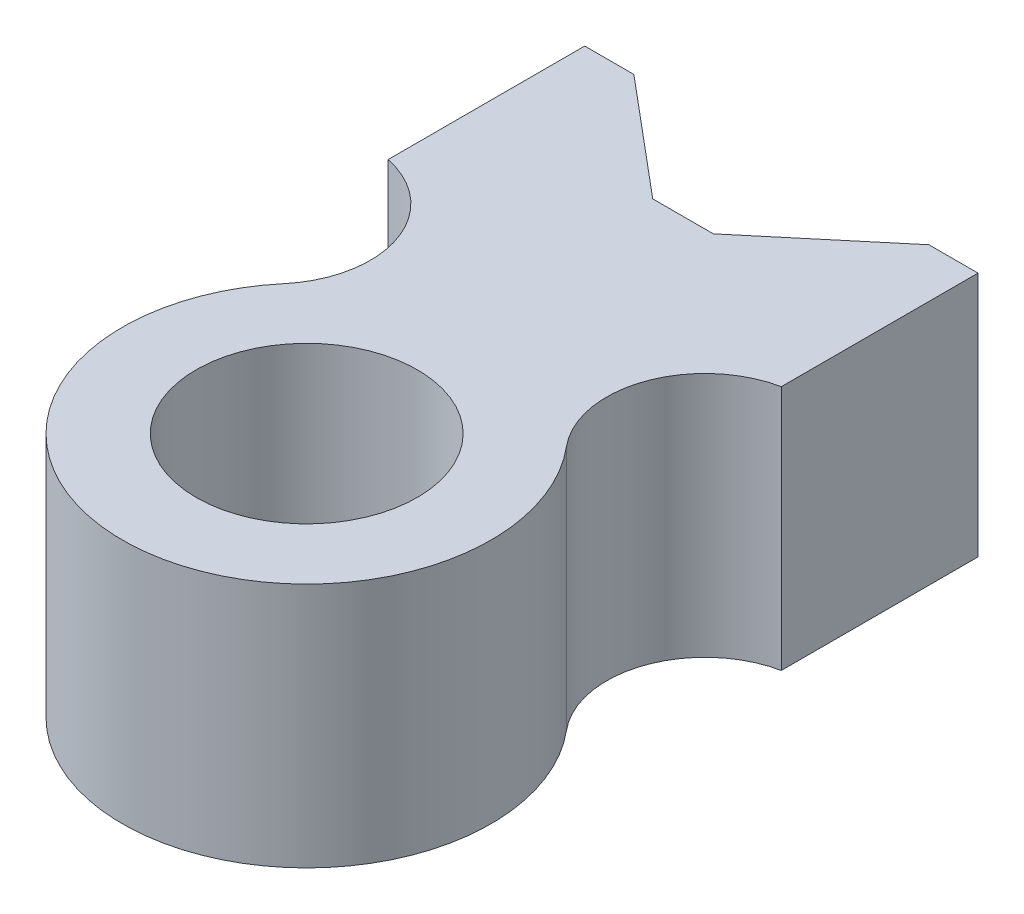
ISO-10303-21;
HEADER;
FILE_DESCRIPTION(('STEP AP214'),'2;1');
FILE_NAME('part.step','',(''),(''),'','','');
FILE_SCHEMA(('AUTOMOTIVE_DESIGN { 1 0 10303 214 1 1 1 1 }'));
ENDSEC;
DATA;
#1=APPLICATION_CONTEXT('core data for automotive mechanical design processes');
#2=APPLICATION_PROTOCOL_DEFINITION('international standard','automotive_design',2000,#1);
#3=PRODUCT_CONTEXT('',#1,'mechanical');
#4=PRODUCT('Part','Part','',(#3));
#5=PRODUCT_RELATED_PRODUCT_CATEGORY('part','',(#4));
#6=PRODUCT_DEFINITION_FORMATION('','',#4);
#7=PRODUCT_DEFINITION_CONTEXT('part definition',#1,'design');
#8=PRODUCT_DEFINITION('design','',#6,#7);
#9=PRODUCT_DEFINITION_SHAPE('','',#8);
#10=(LENGTH_UNIT() NAMED_UNIT(*) SI_UNIT(.MILLI.,.METRE.));
#11=(NAMED_UNIT(*) PLANE_ANGLE_UNIT() SI_UNIT($,.RADIAN.));
#12=(NAMED_UNIT(*) SI_UNIT($,.STERADIAN.) SOLID_ANGLE_UNIT());
#13=UNCERTAINTY_MEASURE_WITH_UNIT(LENGTH_MEASURE(1.E-05),#10,'distance_accuracy_value','');
#14=(GEOMETRIC_REPRESENTATION_CONTEXT(3) GLOBAL_UNCERTAINTY_ASSIGNED_CONTEXT((#13)) GLOBAL_UNIT_ASSIGNED_CONTEXT((#10,
#11,#12)) REPRESENTATION_CONTEXT('',''));
#15=CARTESIAN_POINT('',(0.,0.,0.));
#16=DIRECTION('',(0.,0.,1.));
#17=DIRECTION('',(1.,0.,0.));
#18=AXIS2_PLACEMENT_3D('',#15,#16,#17);
#19=CARTESIAN_POINT('',(44.0475554793413,50.,-36.9602875569759));
#20=DIRECTION('',(0.,1.,0.));
#21=DIRECTION('',(0.,0.,1.));
#22=AXIS2_PLACEMENT_3D('',#19,#20,#21);
#23=PLANE('',#22);
#24=CARTESIAN_POINT('',(44.0475554793413,50.,-36.9602875569759));
#25=DIRECTION('',(0.,-1.,0.));
#26=DIRECTION('',(0.,0.,1.));
#27=AXIS2_PLACEMENT_3D('',#24,#25,#26);
#28=CIRCLE('',#27,20.);
#29=CARTESIAN_POINT('',(28.7266666169617,50.,-24.1045353632451));
#30=VERTEX_POINT('',#29);
#31=CARTESIAN_POINT('',(40.,50.,-56.5464381395088));
#32=VERTEX_POINT('',#31);
#33=EDGE_CURVE('E188',#30,#32,#28,.T.);
#34=ORIENTED_EDGE('',*,*,#33,.T.);
#35=DIRECTION('',(0.,0.,-1.));
#36=VECTOR('',#35,1.);
#37=CARTESIAN_POINT('',(40.,50.,-56.5464381395088));
#38=LINE('',#37,#36);
#39=CARTESIAN_POINT('',(40.,50.,-96.5464381395088));
#40=VERTEX_POINT('',#39);
#41=EDGE_CURVE('E112',#32,#40,#38,.T.);
#42=ORIENTED_EDGE('',*,*,#41,.T.);
#43=DIRECTION('',(-1.,0.,0.));
#44=VECTOR('',#43,1.);
#45=CARTESIAN_POINT('',(40.,50.,-96.5464381395088));
#46=LINE('',#45,#44);
#47=CARTESIAN_POINT('',(30.,50.,-96.5464381395088));
#48=VERTEX_POINT('',#47);
#49=EDGE_CURVE('E217',#40,#48,#46,.T.);
#50=ORIENTED_EDGE('',*,*,#49,.T.);
#51=DIRECTION('',(-0.766044443118975,0.,0.642787609686543));
#52=VECTOR('',#51,1.);
#53=CARTESIAN_POINT('',(30.,50.,-96.5464381395088));
#54=LINE('',#53,#52);
#55=CARTESIAN_POINT('',(6.16492814811606,50.,-76.5464381395088));
#56=VERTEX_POINT('',#55);
#57=EDGE_CURVE('E237',#48,#56,#54,.T.);
#58=ORIENTED_EDGE('',*,*,#57,.T.);
#59=DIRECTION('',(-1.,0.,0.));
#60=VECTOR('',#59,1.);
#61=CARTESIAN_POINT('',(-6.16492814811606,50.,-76.5464381395088));
#62=LINE('',#61,#60);
#63=CARTESIAN_POINT('',(-6.16492814811606,50.,-76.5464381395088));
#64=VERTEX_POINT('',#63);
#65=EDGE_CURVE('E233',#56,#64,#62,.T.);
#66=ORIENTED_EDGE('',*,*,#65,.T.);
#67=DIRECTION('',(-0.766044443118975,0.,-0.642787609686543));
#68=VECTOR('',#67,1.);
#69=CARTESIAN_POINT('',(-30.,50.,-96.5464381395088));
#70=LINE('',#69,#68);
#71=CARTESIAN_POINT('',(-30.,50.,-96.5464381395088));
#72=VERTEX_POINT('',#71);
#73=EDGE_CURVE('E236',#64,#72,#70,.T.);
#74=ORIENTED_EDGE('',*,*,#73,.T.);
#75=DIRECTION('',(-1.,0.,0.));
#76=VECTOR('',#75,1.);
#77=CARTESIAN_POINT('',(-40.,50.,-96.5464381395088));
#78=LINE('',#77,#76);
#79=CARTESIAN_POINT('',(-40.,50.,-96.5464381395088));
#80=VERTEX_POINT('',#79);
#81=EDGE_CURVE('E137',#72,#80,#78,.T.);
#82=ORIENTED_EDGE('',*,*,#81,.T.);
#83=DIRECTION('',(0.,0.,1.));
#84=VECTOR('',#83,1.);
#85=CARTESIAN_POINT('',(-40.,50.,-56.5464381395088));
#86=LINE('',#85,#84);
#87=CARTESIAN_POINT('',(-40.,50.,-56.5464381395088));
#88=VERTEX_POINT('',#87);
#89=EDGE_CURVE('E131',#80,#88,#86,.T.);
#90=ORIENTED_EDGE('',*,*,#89,.T.);
#91=CARTESIAN_POINT('',(-44.0475554793413,50.,-36.9602875569759));
#92=DIRECTION('',(0.,-1.,0.));
#93=DIRECTION('',(0.,0.,1.));
#94=AXIS2_PLACEMENT_3D('',#91,#92,#93);
#95=CIRCLE('',#94,20.);
#96=CARTESIAN_POINT('',(-28.7266666169617,50.,-24.1045353632452));
#97=VERTEX_POINT('',#96);
#98=EDGE_CURVE('E135',#88,#97,#95,.T.);
#99=ORIENTED_EDGE('',*,*,#98,.T.);
#100=CARTESIAN_POINT('',(0.,50.,0.));
#101=DIRECTION('',(0.,1.,0.));
#102=DIRECTION('',(0.,0.,1.));
#103=AXIS2_PLACEMENT_3D('',#100,#101,#102);
#104=CIRCLE('',#103,37.5);
#105=EDGE_CURVE('E63',#97,#30,#104,.T.);
#106=ORIENTED_EDGE('',*,*,#105,.T.);
#107=EDGE_LOOP('',(#34,#42,#50,#58,#66,#74,#82,#90,#99,#106));
#108=FACE_BOUND('',#107,.T.);
#109=CARTESIAN_POINT('',(0.,50.,0.));
#110=DIRECTION('',(0.,1.,0.));
#111=DIRECTION('',(0.,0.,1.));
#112=AXIS2_PLACEMENT_3D('',#109,#110,#111);
#113=CIRCLE('',#112,22.5);
#114=CARTESIAN_POINT('',(0.,50.,22.5));
#115=VERTEX_POINT('',#114);
#116=EDGE_CURVE('E164',#115,#115,#113,.T.);
#117=ORIENTED_EDGE('',*,*,#116,.F.);
#118=EDGE_LOOP('',(#117));
#119=FACE_BOUND('',#118,.T.);
#120=ADVANCED_FACE('F45',(#108,#119),#23,.T.);
#121=CARTESIAN_POINT('',(44.0475554793413,0.,-36.9602875569759));
#122=DIRECTION('',(0.,1.,0.));
#123=DIRECTION('',(0.,0.,1.));
#124=AXIS2_PLACEMENT_3D('',#121,#122,#123);
#125=PLANE('',#124);
#126=CARTESIAN_POINT('',(44.0475554793413,0.,-36.9602875569759));
#127=DIRECTION('',(0.,-1.,0.));
#128=DIRECTION('',(0.,0.,1.));
#129=AXIS2_PLACEMENT_3D('',#126,#127,#128);
#130=CIRCLE('',#129,20.);
#131=CARTESIAN_POINT('',(28.7266666169617,0.,-24.1045353632451));
#132=VERTEX_POINT('',#131);
#133=CARTESIAN_POINT('',(40.,0.,-56.5464381395088));
#134=VERTEX_POINT('',#133);
#135=EDGE_CURVE('E159',#132,#134,#130,.T.);
#136=ORIENTED_EDGE('',*,*,#135,.F.);
#137=CARTESIAN_POINT('',(0.,0.,0.));
#138=DIRECTION('',(0.,1.,0.));
#139=DIRECTION('',(0.,0.,1.));
#140=AXIS2_PLACEMENT_3D('',#137,#138,#139);
#141=CIRCLE('',#140,37.5);
#142=CARTESIAN_POINT('',(-28.7266666169617,0.,-24.1045353632452));
#143=VERTEX_POINT('',#142);
#144=EDGE_CURVE('E104',#143,#132,#141,.T.);
#145=ORIENTED_EDGE('',*,*,#144,.F.);
#146=CARTESIAN_POINT('',(-44.0475554793413,0.,-36.9602875569759));
#147=DIRECTION('',(0.,-1.,0.));
#148=DIRECTION('',(0.,0.,1.));
#149=AXIS2_PLACEMENT_3D('',#146,#147,#148);
#150=CIRCLE('',#149,20.);
#151=CARTESIAN_POINT('',(-40.,0.,-56.5464381395088));
#152=VERTEX_POINT('',#151);
#153=EDGE_CURVE('E98',#152,#143,#150,.T.);
#154=ORIENTED_EDGE('',*,*,#153,.F.);
#155=DIRECTION('',(0.,0.,1.));
#156=VECTOR('',#155,1.);
#157=CARTESIAN_POINT('',(-40.,0.,-56.5464381395088));
#158=LINE('',#157,#156);
#159=CARTESIAN_POINT('',(-40.,0.,-96.5464381395088));
#160=VERTEX_POINT('',#159);
#161=EDGE_CURVE('E146',#160,#152,#158,.T.);
#162=ORIENTED_EDGE('',*,*,#161,.F.);
#163=DIRECTION('',(-1.,0.,0.));
#164=VECTOR('',#163,1.);
#165=CARTESIAN_POINT('',(-40.,0.,-96.5464381395088));
#166=LINE('',#165,#164);
#167=CARTESIAN_POINT('',(-30.,0.,-96.5464381395088));
#168=VERTEX_POINT('',#167);
#169=EDGE_CURVE('E179',#168,#160,#166,.T.);
#170=ORIENTED_EDGE('',*,*,#169,.F.);
#171=DIRECTION('',(-0.766044443118975,0.,-0.642787609686543));
#172=VECTOR('',#171,1.);
#173=CARTESIAN_POINT('',(-30.,0.,-96.5464381395088));
#174=LINE('',#173,#172);
#175=CARTESIAN_POINT('',(-6.16492814811606,0.,-76.5464381395088));
#176=VERTEX_POINT('',#175);
#177=EDGE_CURVE('E176',#176,#168,#174,.T.);
#178=ORIENTED_EDGE('',*,*,#177,.F.);
#179=DIRECTION('',(-1.,0.,0.));
#180=VECTOR('',#179,1.);
#181=CARTESIAN_POINT('',(-6.16492814811606,0.,-76.5464381395088));
#182=LINE('',#181,#180);
#183=CARTESIAN_POINT('',(6.16492814811606,0.,-76.5464381395088));
#184=VERTEX_POINT('',#183);
#185=EDGE_CURVE('E173',#184,#176,#182,.T.);
#186=ORIENTED_EDGE('',*,*,#185,.F.);
#187=DIRECTION('',(-0.766044443118975,0.,0.642787609686543));
#188=VECTOR('',#187,1.);
#189=CARTESIAN_POINT('',(30.,0.,-96.5464381395088));
#190=LINE('',#189,#188);
#191=CARTESIAN_POINT('',(30.,0.,-96.5464381395088));
#192=VERTEX_POINT('',#191);
#193=EDGE_CURVE('E170',#192,#184,#190,.T.);
#194=ORIENTED_EDGE('',*,*,#193,.F.);
#195=DIRECTION('',(-1.,0.,0.));
#196=VECTOR('',#195,1.);
#197=CARTESIAN_POINT('',(40.,0.,-96.5464381395088));
#198=LINE('',#197,#196);
#199=CARTESIAN_POINT('',(40.,0.,-96.5464381395088));
#200=VERTEX_POINT('',#199);
#201=EDGE_CURVE('E167',#200,#192,#198,.T.);
#202=ORIENTED_EDGE('',*,*,#201,.F.);
#203=DIRECTION('',(0.,0.,-1.));
#204=VECTOR('',#203,1.);
#205=CARTESIAN_POINT('',(40.,0.,-56.5464381395088));
#206=LINE('',#205,#204);
#207=EDGE_CURVE('E163',#134,#200,#206,.T.);
#208=ORIENTED_EDGE('',*,*,#207,.F.);
#209=EDGE_LOOP('',(#136,#145,#154,#162,#170,#178,#186,#194,#202,#208));
#210=FACE_BOUND('',#209,.T.);
#211=CARTESIAN_POINT('',(0.,0.,0.));
#212=DIRECTION('',(0.,1.,0.));
#213=DIRECTION('',(0.,0.,1.));
#214=AXIS2_PLACEMENT_3D('',#211,#212,#213);
#215=CIRCLE('',#214,22.5);
#216=CARTESIAN_POINT('',(0.,0.,22.5));
#217=VERTEX_POINT('',#216);
#218=EDGE_CURVE('E251',#217,#217,#215,.T.);
#219=ORIENTED_EDGE('',*,*,#218,.T.);
#220=EDGE_LOOP('',(#219));
#221=FACE_BOUND('',#220,.T.);
#222=ADVANCED_FACE('F221',(#210,#221),#125,.F.);
#223=CARTESIAN_POINT('',(44.0475554793413,50.,-36.9602875569759));
#224=DIRECTION('',(0.,-1.,0.));
#225=DIRECTION('',(0.,0.,-1.));
#226=AXIS2_PLACEMENT_3D('',#223,#224,#225);
#227=CYLINDRICAL_SURFACE('',#226,20.);
#228=ORIENTED_EDGE('',*,*,#135,.T.);
#229=DIRECTION('',(0.,-1.,0.));
#230=VECTOR('',#229,1.);
#231=CARTESIAN_POINT('',(40.,50.,-56.5464381395088));
#232=LINE('',#231,#230);
#233=EDGE_CURVE('E11',#32,#134,#232,.T.);
#234=ORIENTED_EDGE('',*,*,#233,.F.);
#235=ORIENTED_EDGE('',*,*,#33,.F.);
#236=DIRECTION('',(0.,-1.,0.));
#237=VECTOR('',#236,1.);
#238=CARTESIAN_POINT('',(28.7266666169617,50.,-24.1045353632451));
#239=LINE('',#238,#237);
#240=EDGE_CURVE('E155',#30,#132,#239,.T.);
#241=ORIENTED_EDGE('',*,*,#240,.T.);
#242=EDGE_LOOP('',(#228,#234,#235,#241));
#243=FACE_BOUND('',#242,.T.);
#244=ADVANCED_FACE('F47',(#243),#227,.F.);
#245=CARTESIAN_POINT('',(40.,50.,-56.5464381395088));
#246=DIRECTION('',(-1.,0.,0.));
#247=DIRECTION('',(0.,0.,1.));
#248=AXIS2_PLACEMENT_3D('',#245,#246,#247);
#249=PLANE('',#248);
#250=ORIENTED_EDGE('',*,*,#207,.T.);
#251=DIRECTION('',(0.,-1.,0.));
#252=VECTOR('',#251,1.);
#253=CARTESIAN_POINT('',(40.,50.,-96.5464381395088));
#254=LINE('',#253,#252);
#255=EDGE_CURVE('E55',#40,#200,#254,.T.);
#256=ORIENTED_EDGE('',*,*,#255,.F.);
#257=ORIENTED_EDGE('',*,*,#41,.F.);
#258=ORIENTED_EDGE('',*,*,#233,.T.);
#259=EDGE_LOOP('',(#250,#256,#257,#258));
#260=FACE_BOUND('',#259,.T.);
#261=ADVANCED_FACE('F289',(#260),#249,.F.);
#262=CARTESIAN_POINT('',(40.,50.,-96.5464381395088));
#263=DIRECTION('',(0.,0.,1.));
#264=DIRECTION('',(1.,0.,0.));
#265=AXIS2_PLACEMENT_3D('',#262,#263,#264);
#266=PLANE('',#265);
#267=ORIENTED_EDGE('',*,*,#201,.T.);
#268=DIRECTION('',(0.,-1.,0.));
#269=VECTOR('',#268,1.);
#270=CARTESIAN_POINT('',(30.,50.,-96.5464381395088));
#271=LINE('',#270,#269);
#272=EDGE_CURVE('E207',#48,#192,#271,.T.);
#273=ORIENTED_EDGE('',*,*,#272,.F.);
#274=ORIENTED_EDGE('',*,*,#49,.F.);
#275=ORIENTED_EDGE('',*,*,#255,.T.);
#276=EDGE_LOOP('',(#267,#273,#274,#275));
#277=FACE_BOUND('',#276,.T.);
#278=ADVANCED_FACE('F215',(#277),#266,.F.);
#279=CARTESIAN_POINT('',(30.,50.,-96.5464381395088));
#280=DIRECTION('',(0.642787609686544,0.,0.766044443118975));
#281=DIRECTION('',(0.766044443118975,0.,-0.642787609686544));
#282=AXIS2_PLACEMENT_3D('',#279,#280,#281);
#283=PLANE('',#282);
#284=ORIENTED_EDGE('',*,*,#193,.T.);
#285=DIRECTION('',(0.,-1.,0.));
#286=VECTOR('',#285,1.);
#287=CARTESIAN_POINT('',(6.16492814811606,50.,-76.5464381395088));
#288=LINE('',#287,#286);
#289=EDGE_CURVE('E203',#56,#184,#288,.T.);
#290=ORIENTED_EDGE('',*,*,#289,.F.);
#291=ORIENTED_EDGE('',*,*,#57,.F.);
#292=ORIENTED_EDGE('',*,*,#272,.T.);
#293=EDGE_LOOP('',(#284,#290,#291,#292));
#294=FACE_BOUND('',#293,.T.);
#295=ADVANCED_FACE('F227',(#294),#283,.F.);
#296=CARTESIAN_POINT('',(-6.16492814811606,50.,-76.5464381395088));
#297=DIRECTION('',(0.,0.,1.));
#298=DIRECTION('',(1.,0.,0.));
#299=AXIS2_PLACEMENT_3D('',#296,#297,#298);
#300=PLANE('',#299);
#301=ORIENTED_EDGE('',*,*,#185,.T.);
#302=DIRECTION('',(0.,-1.,0.));
#303=VECTOR('',#302,1.);
#304=CARTESIAN_POINT('',(-6.16492814811606,50.,-76.5464381395088));
#305=LINE('',#304,#303);
#306=EDGE_CURVE('E199',#64,#176,#305,.T.);
#307=ORIENTED_EDGE('',*,*,#306,.F.);
#308=ORIENTED_EDGE('',*,*,#65,.F.);
#309=ORIENTED_EDGE('',*,*,#289,.T.);
#310=EDGE_LOOP('',(#301,#307,#308,#309));
#311=FACE_BOUND('',#310,.T.);
#312=ADVANCED_FACE('F231',(#311),#300,.F.);
#313=CARTESIAN_POINT('',(-30.,50.,-96.5464381395088));
#314=DIRECTION('',(-0.642787609686544,0.,0.766044443118975));
#315=DIRECTION('',(0.766044443118975,0.,0.642787609686544));
#316=AXIS2_PLACEMENT_3D('',#313,#314,#315);
#317=PLANE('',#316);
#318=ORIENTED_EDGE('',*,*,#177,.T.);
#319=DIRECTION('',(0.,-1.,0.));
#320=VECTOR('',#319,1.);
#321=CARTESIAN_POINT('',(-30.,50.,-96.5464381395088));
#322=LINE('',#321,#320);
#323=EDGE_CURVE('E195',#72,#168,#322,.T.);
#324=ORIENTED_EDGE('',*,*,#323,.F.);
#325=ORIENTED_EDGE('',*,*,#73,.F.);
#326=ORIENTED_EDGE('',*,*,#306,.T.);
#327=EDGE_LOOP('',(#318,#324,#325,#326));
#328=FACE_BOUND('',#327,.T.);
#329=ADVANCED_FACE('F279',(#328),#317,.F.);
#330=CARTESIAN_POINT('',(-40.,50.,-96.5464381395088));
#331=DIRECTION('',(0.,0.,1.));
#332=DIRECTION('',(1.,0.,0.));
#333=AXIS2_PLACEMENT_3D('',#330,#331,#332);
#334=PLANE('',#333);
#335=ORIENTED_EDGE('',*,*,#169,.T.);
#336=DIRECTION('',(0.,-1.,0.));
#337=VECTOR('',#336,1.);
#338=CARTESIAN_POINT('',(-40.,50.,-96.5464381395088));
#339=LINE('',#338,#337);
#340=EDGE_CURVE('E148',#80,#160,#339,.T.);
#341=ORIENTED_EDGE('',*,*,#340,.F.);
#342=ORIENTED_EDGE('',*,*,#81,.F.);
#343=ORIENTED_EDGE('',*,*,#323,.T.);
#344=EDGE_LOOP('',(#335,#341,#342,#343));
#345=FACE_BOUND('',#344,.T.);
#346=ADVANCED_FACE('F276',(#345),#334,.F.);
#347=CARTESIAN_POINT('',(-40.,50.,-56.5464381395088));
#348=DIRECTION('',(1.,0.,0.));
#349=DIRECTION('',(0.,0.,-1.));
#350=AXIS2_PLACEMENT_3D('',#347,#348,#349);
#351=PLANE('',#350);
#352=ORIENTED_EDGE('',*,*,#161,.T.);
#353=DIRECTION('',(0.,-1.,0.));
#354=VECTOR('',#353,1.);
#355=CARTESIAN_POINT('',(-40.,50.,-56.5464381395088));
#356=LINE('',#355,#354);
#357=EDGE_CURVE('E143',#88,#152,#356,.T.);
#358=ORIENTED_EDGE('',*,*,#357,.F.);
#359=ORIENTED_EDGE('',*,*,#89,.F.);
#360=ORIENTED_EDGE('',*,*,#340,.T.);
#361=EDGE_LOOP('',(#352,#358,#359,#360));
#362=FACE_BOUND('',#361,.T.);
#363=ADVANCED_FACE('F144',(#362),#351,.F.);
#364=CARTESIAN_POINT('',(-44.0475554793413,50.,-36.9602875569759));
#365=DIRECTION('',(0.,-1.,0.));
#366=DIRECTION('',(0.,0.,-1.));
#367=AXIS2_PLACEMENT_3D('',#364,#365,#366);
#368=CYLINDRICAL_SURFACE('',#367,20.);
#369=ORIENTED_EDGE('',*,*,#153,.T.);
#370=DIRECTION('',(0.,-1.,0.));
#371=VECTOR('',#370,1.);
#372=CARTESIAN_POINT('',(-28.7266666169617,50.,-24.1045353632452));
#373=LINE('',#372,#371);
#374=EDGE_CURVE('E149',#97,#143,#373,.T.);
#375=ORIENTED_EDGE('',*,*,#374,.F.);
#376=ORIENTED_EDGE('',*,*,#98,.F.);
#377=ORIENTED_EDGE('',*,*,#357,.T.);
#378=EDGE_LOOP('',(#369,#375,#376,#377));
#379=FACE_BOUND('',#378,.T.);
#380=ADVANCED_FACE('F151',(#379),#368,.F.);
#381=CARTESIAN_POINT('',(0.,50.,0.));
#382=DIRECTION('',(0.,-1.,0.));
#383=DIRECTION('',(0.,0.,-1.));
#384=AXIS2_PLACEMENT_3D('',#381,#382,#383);
#385=CYLINDRICAL_SURFACE('',#384,37.5);
#386=ORIENTED_EDGE('',*,*,#144,.T.);
#387=ORIENTED_EDGE('',*,*,#240,.F.);
#388=ORIENTED_EDGE('',*,*,#105,.F.);
#389=ORIENTED_EDGE('',*,*,#374,.T.);
#390=EDGE_LOOP('',(#386,#387,#388,#389));
#391=FACE_BOUND('',#390,.T.);
#392=ADVANCED_FACE('F269',(#391),#385,.T.);
#393=CARTESIAN_POINT('',(0.,50.,0.));
#394=DIRECTION('',(0.,-1.,0.));
#395=DIRECTION('',(0.,0.,-1.));
#396=AXIS2_PLACEMENT_3D('',#393,#394,#395);
#397=CYLINDRICAL_SURFACE('',#396,22.5);
#398=ORIENTED_EDGE('',*,*,#116,.T.);
#399=EDGE_LOOP('',(#398));
#400=FACE_BOUND('',#399,.T.);
#401=ORIENTED_EDGE('',*,*,#218,.F.);
#402=EDGE_LOOP('',(#401));
#403=FACE_BOUND('',#402,.T.);
#404=ADVANCED_FACE('F259',(#400,#403),#397,.F.);
#405=CLOSED_SHELL('',(#120,#222,#244,#261,#278,#295,#312,#329,#346,#363,#380,#392,#404));
#406=MANIFOLD_SOLID_BREP('B2',#405);
#407=ADVANCED_BREP_SHAPE_REPRESENTATION('',(#18,#406),#14);
#408=SHAPE_DEFINITION_REPRESENTATION(#9,#407);
ENDSEC;
END-ISO-10303-21;
